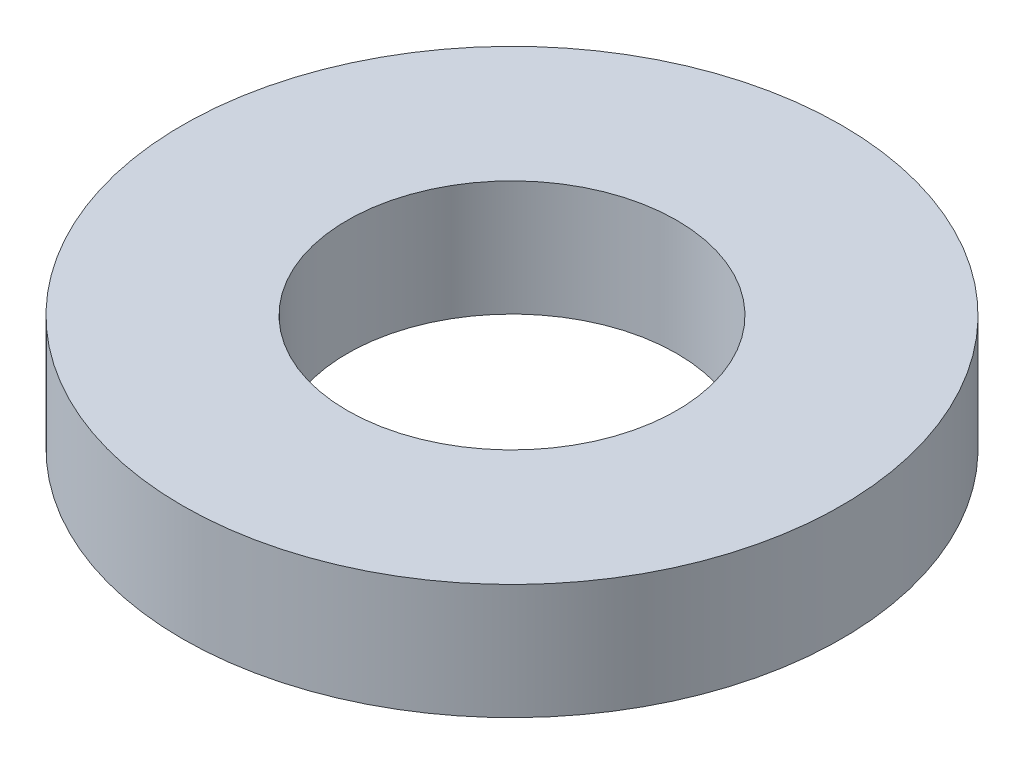
ISO-10303-21;
HEADER;
FILE_DESCRIPTION(('STEP AP214'),'2;1');
FILE_NAME('part.step','',(''),(''),'','','');
FILE_SCHEMA(('AUTOMOTIVE_DESIGN { 1 0 10303 214 1 1 1 1 }'));
ENDSEC;
DATA;
#1=APPLICATION_CONTEXT('core data for automotive mechanical design processes');
#2=APPLICATION_PROTOCOL_DEFINITION('international standard','automotive_design',2000,#1);
#3=PRODUCT_CONTEXT('',#1,'mechanical');
#4=PRODUCT('Part','Part','',(#3));
#5=PRODUCT_RELATED_PRODUCT_CATEGORY('part','',(#4));
#6=PRODUCT_DEFINITION_FORMATION('','',#4);
#7=PRODUCT_DEFINITION_CONTEXT('part definition',#1,'design');
#8=PRODUCT_DEFINITION('design','',#6,#7);
#9=PRODUCT_DEFINITION_SHAPE('','',#8);
#10=(LENGTH_UNIT() NAMED_UNIT(*) SI_UNIT(.MILLI.,.METRE.));
#11=(NAMED_UNIT(*) PLANE_ANGLE_UNIT() SI_UNIT($,.RADIAN.));
#12=(NAMED_UNIT(*) SI_UNIT($,.STERADIAN.) SOLID_ANGLE_UNIT());
#13=UNCERTAINTY_MEASURE_WITH_UNIT(LENGTH_MEASURE(1.E-05),#10,'distance_accuracy_value','');
#14=(GEOMETRIC_REPRESENTATION_CONTEXT(3) GLOBAL_UNCERTAINTY_ASSIGNED_CONTEXT((#13)) GLOBAL_UNIT_ASSIGNED_CONTEXT((#10,
#11,#12)) REPRESENTATION_CONTEXT('',''));
#15=CARTESIAN_POINT('',(0.,0.,0.));
#16=DIRECTION('',(0.,0.,1.));
#17=DIRECTION('',(1.,0.,0.));
#18=AXIS2_PLACEMENT_3D('',#15,#16,#17);
#19=CARTESIAN_POINT('',(0.,28.,0.));
#20=DIRECTION('',(0.,-1.,0.));
#21=DIRECTION('',(0.,0.,-1.));
#22=AXIS2_PLACEMENT_3D('',#19,#20,#21);
#23=CYLINDRICAL_SURFACE('',#22,80.);
#24=CARTESIAN_POINT('',(0.,28.,0.));
#25=DIRECTION('',(0.,1.,0.));
#26=DIRECTION('',(0.,0.,1.));
#27=AXIS2_PLACEMENT_3D('',#24,#25,#26);
#28=CIRCLE('',#27,80.);
#29=CARTESIAN_POINT('',(0.,28.,80.));
#30=VERTEX_POINT('',#29);
#31=EDGE_CURVE('E10',#30,#30,#28,.T.);
#32=ORIENTED_EDGE('',*,*,#31,.F.);
#33=EDGE_LOOP('',(#32));
#34=FACE_BOUND('',#33,.T.);
#35=CARTESIAN_POINT('',(0.,0.,0.));
#36=DIRECTION('',(0.,1.,0.));
#37=DIRECTION('',(0.,0.,1.));
#38=AXIS2_PLACEMENT_3D('',#35,#36,#37);
#39=CIRCLE('',#38,80.);
#40=CARTESIAN_POINT('',(0.,0.,80.));
#41=VERTEX_POINT('',#40);
#42=EDGE_CURVE('E37',#41,#41,#39,.T.);
#43=ORIENTED_EDGE('',*,*,#42,.T.);
#44=EDGE_LOOP('',(#43));
#45=FACE_BOUND('',#44,.T.);
#46=ADVANCED_FACE('F40',(#34,#45),#23,.T.);
#47=CARTESIAN_POINT('',(0.,28.,0.));
#48=DIRECTION('',(0.,1.,0.));
#49=DIRECTION('',(0.,0.,1.));
#50=AXIS2_PLACEMENT_3D('',#47,#48,#49);
#51=PLANE('',#50);
#52=CARTESIAN_POINT('',(0.,28.,0.));
#53=DIRECTION('',(0.,1.,0.));
#54=DIRECTION('',(0.,0.,1.));
#55=AXIS2_PLACEMENT_3D('',#52,#53,#54);
#56=CIRCLE('',#55,40.);
#57=CARTESIAN_POINT('',(0.,28.,40.));
#58=VERTEX_POINT('',#57);
#59=EDGE_CURVE('E50',#58,#58,#56,.T.);
#60=ORIENTED_EDGE('',*,*,#59,.F.);
#61=EDGE_LOOP('',(#60));
#62=FACE_BOUND('',#61,.T.);
#63=ORIENTED_EDGE('',*,*,#31,.T.);
#64=EDGE_LOOP('',(#63));
#65=FACE_BOUND('',#64,.T.);
#66=ADVANCED_FACE('F59',(#62,#65),#51,.T.);
#67=CARTESIAN_POINT('',(0.,0.,0.));
#68=DIRECTION('',(0.,1.,0.));
#69=DIRECTION('',(0.,0.,1.));
#70=AXIS2_PLACEMENT_3D('',#67,#68,#69);
#71=PLANE('',#70);
#72=CARTESIAN_POINT('',(0.,0.,0.));
#73=DIRECTION('',(0.,1.,0.));
#74=DIRECTION('',(0.,0.,1.));
#75=AXIS2_PLACEMENT_3D('',#72,#73,#74);
#76=CIRCLE('',#75,40.);
#77=CARTESIAN_POINT('',(0.,0.,40.));
#78=VERTEX_POINT('',#77);
#79=EDGE_CURVE('E47',#78,#78,#76,.T.);
#80=ORIENTED_EDGE('',*,*,#79,.T.);
#81=EDGE_LOOP('',(#80));
#82=FACE_BOUND('',#81,.T.);
#83=ORIENTED_EDGE('',*,*,#42,.F.);
#84=EDGE_LOOP('',(#83));
#85=FACE_BOUND('',#84,.T.);
#86=ADVANCED_FACE('F58',(#82,#85),#71,.F.);
#87=CARTESIAN_POINT('',(0.,28.,0.));
#88=DIRECTION('',(0.,-1.,0.));
#89=DIRECTION('',(0.,0.,-1.));
#90=AXIS2_PLACEMENT_3D('',#87,#88,#89);
#91=CYLINDRICAL_SURFACE('',#90,40.);
#92=ORIENTED_EDGE('',*,*,#59,.T.);
#93=EDGE_LOOP('',(#92));
#94=FACE_BOUND('',#93,.T.);
#95=ORIENTED_EDGE('',*,*,#79,.F.);
#96=EDGE_LOOP('',(#95));
#97=FACE_BOUND('',#96,.T.);
#98=ADVANCED_FACE('F54',(#94,#97),#91,.F.);
#99=CLOSED_SHELL('',(#46,#66,#86,#98));
#100=MANIFOLD_SOLID_BREP('B2',#99);
#101=ADVANCED_BREP_SHAPE_REPRESENTATION('',(#18,#100),#14);
#102=SHAPE_DEFINITION_REPRESENTATION(#9,#101);
ENDSEC;
END-ISO-10303-21;
